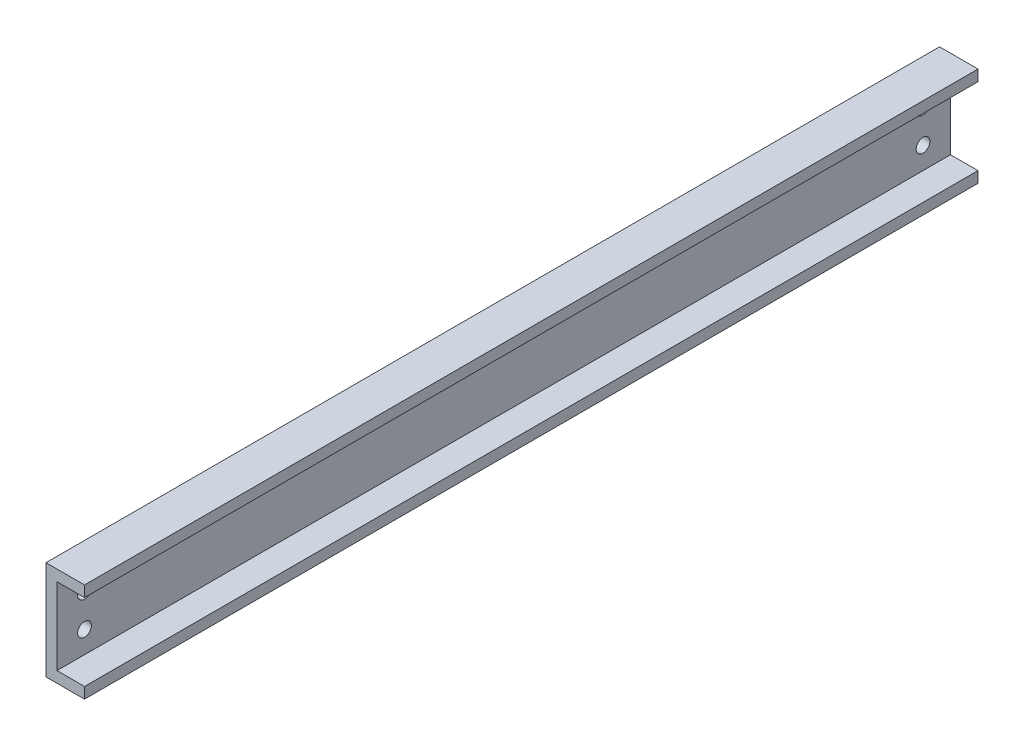
ISO-10303-21;
HEADER;
FILE_DESCRIPTION(('STEP AP214'),'2;1');
FILE_NAME('part.step','',(''),(''),'','','');
FILE_SCHEMA(('AUTOMOTIVE_DESIGN { 1 0 10303 214 1 1 1 1 }'));
ENDSEC;
DATA;
#1=APPLICATION_CONTEXT('core data for automotive mechanical design processes');
#2=APPLICATION_PROTOCOL_DEFINITION('international standard','automotive_design',2000,#1);
#3=PRODUCT_CONTEXT('',#1,'mechanical');
#4=PRODUCT('Part','Part','',(#3));
#5=PRODUCT_RELATED_PRODUCT_CATEGORY('part','',(#4));
#6=PRODUCT_DEFINITION_FORMATION('','',#4);
#7=PRODUCT_DEFINITION_CONTEXT('part definition',#1,'design');
#8=PRODUCT_DEFINITION('design','',#6,#7);
#9=PRODUCT_DEFINITION_SHAPE('','',#8);
#10=(LENGTH_UNIT() NAMED_UNIT(*) SI_UNIT(.MILLI.,.METRE.));
#11=(NAMED_UNIT(*) PLANE_ANGLE_UNIT() SI_UNIT($,.RADIAN.));
#12=(NAMED_UNIT(*) SI_UNIT($,.STERADIAN.) SOLID_ANGLE_UNIT());
#13=UNCERTAINTY_MEASURE_WITH_UNIT(LENGTH_MEASURE(1.E-05),#10,'distance_accuracy_value','');
#14=(GEOMETRIC_REPRESENTATION_CONTEXT(3) GLOBAL_UNCERTAINTY_ASSIGNED_CONTEXT((#13)) GLOBAL_UNIT_ASSIGNED_CONTEXT((#10,
#11,#12)) REPRESENTATION_CONTEXT('',''));
#15=CARTESIAN_POINT('',(0.,0.,0.));
#16=DIRECTION('',(0.,0.,1.));
#17=DIRECTION('',(1.,0.,0.));
#18=AXIS2_PLACEMENT_3D('',#15,#16,#17);
#19=CARTESIAN_POINT('',(0.,9.,-162.5));
#20=DIRECTION('',(0.,1.,0.));
#21=DIRECTION('',(0.,0.,1.));
#22=AXIS2_PLACEMENT_3D('',#19,#20,#21);
#23=PLANE('',#22);
#24=DIRECTION('',(-1.,0.,0.));
#25=VECTOR('',#24,1.);
#26=CARTESIAN_POINT('',(0.,9.,0.));
#27=LINE('',#26,#25);
#28=CARTESIAN_POINT('',(7.,9.,0.));
#29=VERTEX_POINT('',#28);
#30=CARTESIAN_POINT('',(0.,9.,0.));
#31=VERTEX_POINT('',#30);
#32=EDGE_CURVE('E134',#29,#31,#27,.T.);
#33=ORIENTED_EDGE('',*,*,#32,.F.);
#34=DIRECTION('',(0.,0.,1.));
#35=VECTOR('',#34,1.);
#36=CARTESIAN_POINT('',(7.,9.,-162.5));
#37=LINE('',#36,#35);
#38=CARTESIAN_POINT('',(7.,9.,-162.5));
#39=VERTEX_POINT('',#38);
#40=EDGE_CURVE('E11',#39,#29,#37,.T.);
#41=ORIENTED_EDGE('',*,*,#40,.F.);
#42=DIRECTION('',(-1.,0.,0.));
#43=VECTOR('',#42,1.);
#44=CARTESIAN_POINT('',(0.,9.,-162.5));
#45=LINE('',#44,#43);
#46=CARTESIAN_POINT('',(0.,9.,-162.5));
#47=VERTEX_POINT('',#46);
#48=EDGE_CURVE('E155',#39,#47,#45,.T.);
#49=ORIENTED_EDGE('',*,*,#48,.T.);
#50=DIRECTION('',(0.,0.,1.));
#51=VECTOR('',#50,1.);
#52=CARTESIAN_POINT('',(0.,9.,-162.5));
#53=LINE('',#52,#51);
#54=EDGE_CURVE('E40',#47,#31,#53,.T.);
#55=ORIENTED_EDGE('',*,*,#54,.T.);
#56=EDGE_LOOP('',(#33,#41,#49,#55));
#57=FACE_BOUND('',#56,.T.);
#58=ADVANCED_FACE('F37',(#57),#23,.T.);
#59=CARTESIAN_POINT('',(7.,9.,-162.5));
#60=DIRECTION('',(1.,0.,0.));
#61=DIRECTION('',(0.,0.,-1.));
#62=AXIS2_PLACEMENT_3D('',#59,#60,#61);
#63=PLANE('',#62);
#64=DIRECTION('',(0.,1.,0.));
#65=VECTOR('',#64,1.);
#66=CARTESIAN_POINT('',(7.,9.,0.));
#67=LINE('',#66,#65);
#68=CARTESIAN_POINT('',(7.,7.,0.));
#69=VERTEX_POINT('',#68);
#70=EDGE_CURVE('E153',#69,#29,#67,.T.);
#71=ORIENTED_EDGE('',*,*,#70,.F.);
#72=DIRECTION('',(0.,0.,1.));
#73=VECTOR('',#72,1.);
#74=CARTESIAN_POINT('',(7.,7.,-162.5));
#75=LINE('',#74,#73);
#76=CARTESIAN_POINT('',(7.,7.,-162.5));
#77=VERTEX_POINT('',#76);
#78=EDGE_CURVE('E46',#77,#69,#75,.T.);
#79=ORIENTED_EDGE('',*,*,#78,.F.);
#80=DIRECTION('',(0.,1.,0.));
#81=VECTOR('',#80,1.);
#82=CARTESIAN_POINT('',(7.,9.,-162.5));
#83=LINE('',#82,#81);
#84=EDGE_CURVE('E124',#77,#39,#83,.T.);
#85=ORIENTED_EDGE('',*,*,#84,.T.);
#86=ORIENTED_EDGE('',*,*,#40,.T.);
#87=EDGE_LOOP('',(#71,#79,#85,#86));
#88=FACE_BOUND('',#87,.T.);
#89=ADVANCED_FACE('F167',(#88),#63,.T.);
#90=CARTESIAN_POINT('',(2.,7.,-162.5));
#91=DIRECTION('',(0.,-1.,0.));
#92=DIRECTION('',(0.,0.,-1.));
#93=AXIS2_PLACEMENT_3D('',#90,#91,#92);
#94=PLANE('',#93);
#95=DIRECTION('',(1.,0.,0.));
#96=VECTOR('',#95,1.);
#97=CARTESIAN_POINT('',(2.,7.,0.));
#98=LINE('',#97,#96);
#99=CARTESIAN_POINT('',(2.,7.,0.));
#100=VERTEX_POINT('',#99);
#101=EDGE_CURVE('E111',#100,#69,#98,.T.);
#102=ORIENTED_EDGE('',*,*,#101,.F.);
#103=DIRECTION('',(0.,0.,1.));
#104=VECTOR('',#103,1.);
#105=CARTESIAN_POINT('',(2.,7.,-162.5));
#106=LINE('',#105,#104);
#107=CARTESIAN_POINT('',(2.,7.,-162.5));
#108=VERTEX_POINT('',#107);
#109=EDGE_CURVE('E106',#108,#100,#106,.T.);
#110=ORIENTED_EDGE('',*,*,#109,.F.);
#111=DIRECTION('',(1.,0.,0.));
#112=VECTOR('',#111,1.);
#113=CARTESIAN_POINT('',(2.,7.,-162.5));
#114=LINE('',#113,#112);
#115=EDGE_CURVE('E109',#108,#77,#114,.T.);
#116=ORIENTED_EDGE('',*,*,#115,.T.);
#117=ORIENTED_EDGE('',*,*,#78,.T.);
#118=EDGE_LOOP('',(#102,#110,#116,#117));
#119=FACE_BOUND('',#118,.T.);
#120=ADVANCED_FACE('F108',(#119),#94,.T.);
#121=CARTESIAN_POINT('',(2.,7.,-162.5));
#122=DIRECTION('',(1.,0.,0.));
#123=DIRECTION('',(0.,0.,-1.));
#124=AXIS2_PLACEMENT_3D('',#121,#122,#123);
#125=PLANE('',#124);
#126=CARTESIAN_POINT('',(2.,2.99999999999998,-157.5));
#127=DIRECTION('',(1.,0.,0.));
#128=DIRECTION('',(0.,0.,-1.));
#129=AXIS2_PLACEMENT_3D('',#126,#127,#128);
#130=CIRCLE('',#129,1.25000000000001);
#131=CARTESIAN_POINT('',(2.,2.99999999999998,-158.75));
#132=VERTEX_POINT('',#131);
#133=EDGE_CURVE('E138',#132,#132,#130,.T.);
#134=ORIENTED_EDGE('',*,*,#133,.F.);
#135=EDGE_LOOP('',(#134));
#136=FACE_BOUND('',#135,.T.);
#137=CARTESIAN_POINT('',(2.,-3.00000000000002,-157.5));
#138=DIRECTION('',(1.,0.,0.));
#139=DIRECTION('',(0.,0.,-1.));
#140=AXIS2_PLACEMENT_3D('',#137,#138,#139);
#141=CIRCLE('',#140,1.25000000000001);
#142=CARTESIAN_POINT('',(2.,-3.00000000000002,-158.75));
#143=VERTEX_POINT('',#142);
#144=EDGE_CURVE('E225',#143,#143,#141,.T.);
#145=ORIENTED_EDGE('',*,*,#144,.F.);
#146=EDGE_LOOP('',(#145));
#147=FACE_BOUND('',#146,.T.);
#148=CARTESIAN_POINT('',(2.,-3.,-5.));
#149=DIRECTION('',(1.,0.,0.));
#150=DIRECTION('',(0.,0.,-1.));
#151=AXIS2_PLACEMENT_3D('',#148,#149,#150);
#152=CIRCLE('',#151,1.25);
#153=CARTESIAN_POINT('',(2.,-3.,-6.25));
#154=VERTEX_POINT('',#153);
#155=EDGE_CURVE('E217',#154,#154,#152,.T.);
#156=ORIENTED_EDGE('',*,*,#155,.F.);
#157=EDGE_LOOP('',(#156));
#158=FACE_BOUND('',#157,.T.);
#159=CARTESIAN_POINT('',(2.,3.,-5.));
#160=DIRECTION('',(1.,0.,0.));
#161=DIRECTION('',(0.,0.,-1.));
#162=AXIS2_PLACEMENT_3D('',#159,#160,#161);
#163=CIRCLE('',#162,1.25);
#164=CARTESIAN_POINT('',(2.,3.,-6.25));
#165=VERTEX_POINT('',#164);
#166=EDGE_CURVE('E214',#165,#165,#163,.T.);
#167=ORIENTED_EDGE('',*,*,#166,.F.);
#168=EDGE_LOOP('',(#167));
#169=FACE_BOUND('',#168,.T.);
#170=DIRECTION('',(0.,1.,0.));
#171=VECTOR('',#170,1.);
#172=CARTESIAN_POINT('',(2.,7.,0.));
#173=LINE('',#172,#171);
#174=CARTESIAN_POINT('',(2.,-7.,0.));
#175=VERTEX_POINT('',#174);
#176=EDGE_CURVE('E150',#175,#100,#173,.T.);
#177=ORIENTED_EDGE('',*,*,#176,.F.);
#178=DIRECTION('',(0.,0.,1.));
#179=VECTOR('',#178,1.);
#180=CARTESIAN_POINT('',(2.,-7.,-162.5));
#181=LINE('',#180,#179);
#182=CARTESIAN_POINT('',(2.,-7.,-162.5));
#183=VERTEX_POINT('',#182);
#184=EDGE_CURVE('E116',#183,#175,#181,.T.);
#185=ORIENTED_EDGE('',*,*,#184,.F.);
#186=DIRECTION('',(0.,1.,0.));
#187=VECTOR('',#186,1.);
#188=CARTESIAN_POINT('',(2.,7.,-162.5));
#189=LINE('',#188,#187);
#190=EDGE_CURVE('E122',#183,#108,#189,.T.);
#191=ORIENTED_EDGE('',*,*,#190,.T.);
#192=ORIENTED_EDGE('',*,*,#109,.T.);
#193=EDGE_LOOP('',(#177,#185,#191,#192));
#194=FACE_BOUND('',#193,.T.);
#195=ADVANCED_FACE('F126',(#136,#147,#158,#169,#194),#125,.T.);
#196=CARTESIAN_POINT('',(2.,-7.,-162.5));
#197=DIRECTION('',(0.,1.,0.));
#198=DIRECTION('',(-1.,0.,0.));
#199=AXIS2_PLACEMENT_3D('',#196,#197,#198);
#200=PLANE('',#199);
#201=DIRECTION('',(-1.,0.,0.));
#202=VECTOR('',#201,1.);
#203=CARTESIAN_POINT('',(2.,-7.,0.));
#204=LINE('',#203,#202);
#205=CARTESIAN_POINT('',(7.,-7.,0.));
#206=VERTEX_POINT('',#205);
#207=EDGE_CURVE('E147',#206,#175,#204,.T.);
#208=ORIENTED_EDGE('',*,*,#207,.F.);
#209=DIRECTION('',(0.,0.,1.));
#210=VECTOR('',#209,1.);
#211=CARTESIAN_POINT('',(7.,-7.,-162.5));
#212=LINE('',#211,#210);
#213=CARTESIAN_POINT('',(7.,-7.,-162.5));
#214=VERTEX_POINT('',#213);
#215=EDGE_CURVE('E159',#214,#206,#212,.T.);
#216=ORIENTED_EDGE('',*,*,#215,.F.);
#217=DIRECTION('',(-1.,0.,0.));
#218=VECTOR('',#217,1.);
#219=CARTESIAN_POINT('',(2.,-7.,-162.5));
#220=LINE('',#219,#218);
#221=EDGE_CURVE('E127',#214,#183,#220,.T.);
#222=ORIENTED_EDGE('',*,*,#221,.T.);
#223=ORIENTED_EDGE('',*,*,#184,.T.);
#224=EDGE_LOOP('',(#208,#216,#222,#223));
#225=FACE_BOUND('',#224,.T.);
#226=ADVANCED_FACE('F180',(#225),#200,.T.);
#227=CARTESIAN_POINT('',(7.,-9.,-162.5));
#228=DIRECTION('',(1.,0.,0.));
#229=DIRECTION('',(0.,0.,-1.));
#230=AXIS2_PLACEMENT_3D('',#227,#228,#229);
#231=PLANE('',#230);
#232=DIRECTION('',(0.,1.,0.));
#233=VECTOR('',#232,1.);
#234=CARTESIAN_POINT('',(7.,-9.,0.));
#235=LINE('',#234,#233);
#236=CARTESIAN_POINT('',(7.,-9.,0.));
#237=VERTEX_POINT('',#236);
#238=EDGE_CURVE('E144',#237,#206,#235,.T.);
#239=ORIENTED_EDGE('',*,*,#238,.F.);
#240=DIRECTION('',(0.,0.,1.));
#241=VECTOR('',#240,1.);
#242=CARTESIAN_POINT('',(7.,-9.,-162.5));
#243=LINE('',#242,#241);
#244=CARTESIAN_POINT('',(7.,-9.,-162.5));
#245=VERTEX_POINT('',#244);
#246=EDGE_CURVE('E161',#245,#237,#243,.T.);
#247=ORIENTED_EDGE('',*,*,#246,.F.);
#248=DIRECTION('',(0.,1.,0.));
#249=VECTOR('',#248,1.);
#250=CARTESIAN_POINT('',(7.,-9.,-162.5));
#251=LINE('',#250,#249);
#252=EDGE_CURVE('E129',#245,#214,#251,.T.);
#253=ORIENTED_EDGE('',*,*,#252,.T.);
#254=ORIENTED_EDGE('',*,*,#215,.T.);
#255=EDGE_LOOP('',(#239,#247,#253,#254));
#256=FACE_BOUND('',#255,.T.);
#257=ADVANCED_FACE('F184',(#256),#231,.T.);
#258=CARTESIAN_POINT('',(0.,-9.,-162.5));
#259=DIRECTION('',(0.,-1.,0.));
#260=DIRECTION('',(0.,0.,-1.));
#261=AXIS2_PLACEMENT_3D('',#258,#259,#260);
#262=PLANE('',#261);
#263=DIRECTION('',(1.,0.,0.));
#264=VECTOR('',#263,1.);
#265=CARTESIAN_POINT('',(0.,-9.,0.));
#266=LINE('',#265,#264);
#267=CARTESIAN_POINT('',(0.,-9.,0.));
#268=VERTEX_POINT('',#267);
#269=EDGE_CURVE('E141',#268,#237,#266,.T.);
#270=ORIENTED_EDGE('',*,*,#269,.F.);
#271=DIRECTION('',(0.,0.,1.));
#272=VECTOR('',#271,1.);
#273=CARTESIAN_POINT('',(0.,-9.,-162.5));
#274=LINE('',#273,#272);
#275=CARTESIAN_POINT('',(0.,-9.,-162.5));
#276=VERTEX_POINT('',#275);
#277=EDGE_CURVE('E162',#276,#268,#274,.T.);
#278=ORIENTED_EDGE('',*,*,#277,.F.);
#279=DIRECTION('',(1.,0.,0.));
#280=VECTOR('',#279,1.);
#281=CARTESIAN_POINT('',(0.,-9.,-162.5));
#282=LINE('',#281,#280);
#283=EDGE_CURVE('E233',#276,#245,#282,.T.);
#284=ORIENTED_EDGE('',*,*,#283,.T.);
#285=ORIENTED_EDGE('',*,*,#246,.T.);
#286=EDGE_LOOP('',(#270,#278,#284,#285));
#287=FACE_BOUND('',#286,.T.);
#288=ADVANCED_FACE('F188',(#287),#262,.T.);
#289=CARTESIAN_POINT('',(0.,9.,-162.5));
#290=DIRECTION('',(-1.,0.,0.));
#291=DIRECTION('',(0.,-1.,0.));
#292=AXIS2_PLACEMENT_3D('',#289,#290,#291);
#293=PLANE('',#292);
#294=CARTESIAN_POINT('',(0.,2.99999999999998,-157.5));
#295=DIRECTION('',(-1.,0.,0.));
#296=DIRECTION('',(0.,1.,0.));
#297=AXIS2_PLACEMENT_3D('',#294,#295,#296);
#298=CIRCLE('',#297,1.25000000000001);
#299=CARTESIAN_POINT('',(0.,4.24999999999999,-157.5));
#300=VERTEX_POINT('',#299);
#301=EDGE_CURVE('E201',#300,#300,#298,.T.);
#302=ORIENTED_EDGE('',*,*,#301,.F.);
#303=EDGE_LOOP('',(#302));
#304=FACE_BOUND('',#303,.T.);
#305=CARTESIAN_POINT('',(0.,-3.00000000000002,-157.5));
#306=DIRECTION('',(-1.,0.,0.));
#307=DIRECTION('',(0.,-1.,0.));
#308=AXIS2_PLACEMENT_3D('',#305,#306,#307);
#309=CIRCLE('',#308,1.25000000000001);
#310=CARTESIAN_POINT('',(0.,-4.25000000000003,-157.5));
#311=VERTEX_POINT('',#310);
#312=EDGE_CURVE('E205',#311,#311,#309,.T.);
#313=ORIENTED_EDGE('',*,*,#312,.F.);
#314=EDGE_LOOP('',(#313));
#315=FACE_BOUND('',#314,.T.);
#316=CARTESIAN_POINT('',(0.,-3.,-5.));
#317=DIRECTION('',(-1.,0.,0.));
#318=DIRECTION('',(0.,1.,0.));
#319=AXIS2_PLACEMENT_3D('',#316,#317,#318);
#320=CIRCLE('',#319,1.25);
#321=CARTESIAN_POINT('',(0.,-1.75,-5.));
#322=VERTEX_POINT('',#321);
#323=EDGE_CURVE('E209',#322,#322,#320,.T.);
#324=ORIENTED_EDGE('',*,*,#323,.F.);
#325=EDGE_LOOP('',(#324));
#326=FACE_BOUND('',#325,.T.);
#327=CARTESIAN_POINT('',(0.,3.,-5.));
#328=DIRECTION('',(-1.,0.,0.));
#329=DIRECTION('',(0.,-1.,0.));
#330=AXIS2_PLACEMENT_3D('',#327,#328,#329);
#331=CIRCLE('',#330,1.25);
#332=CARTESIAN_POINT('',(0.,1.75,-5.));
#333=VERTEX_POINT('',#332);
#334=EDGE_CURVE('E212',#333,#333,#331,.T.);
#335=ORIENTED_EDGE('',*,*,#334,.F.);
#336=EDGE_LOOP('',(#335));
#337=FACE_BOUND('',#336,.T.);
#338=DIRECTION('',(0.,-1.,0.));
#339=VECTOR('',#338,1.);
#340=CARTESIAN_POINT('',(0.,9.,0.));
#341=LINE('',#340,#339);
#342=EDGE_CURVE('E137',#31,#268,#341,.T.);
#343=ORIENTED_EDGE('',*,*,#342,.F.);
#344=ORIENTED_EDGE('',*,*,#54,.F.);
#345=DIRECTION('',(0.,-1.,0.));
#346=VECTOR('',#345,1.);
#347=CARTESIAN_POINT('',(0.,9.,-162.5));
#348=LINE('',#347,#346);
#349=EDGE_CURVE('E231',#47,#276,#348,.T.);
#350=ORIENTED_EDGE('',*,*,#349,.T.);
#351=ORIENTED_EDGE('',*,*,#277,.T.);
#352=EDGE_LOOP('',(#343,#344,#350,#351));
#353=FACE_BOUND('',#352,.T.);
#354=ADVANCED_FACE('F164',(#304,#315,#326,#337,#353),#293,.T.);
#355=CARTESIAN_POINT('',(0.,0.,-162.5));
#356=DIRECTION('',(0.,0.,-1.));
#357=DIRECTION('',(-1.,0.,0.));
#358=AXIS2_PLACEMENT_3D('',#355,#356,#357);
#359=PLANE('',#358);
#360=ORIENTED_EDGE('',*,*,#48,.F.);
#361=ORIENTED_EDGE('',*,*,#84,.F.);
#362=ORIENTED_EDGE('',*,*,#115,.F.);
#363=ORIENTED_EDGE('',*,*,#190,.F.);
#364=ORIENTED_EDGE('',*,*,#221,.F.);
#365=ORIENTED_EDGE('',*,*,#252,.F.);
#366=ORIENTED_EDGE('',*,*,#283,.F.);
#367=ORIENTED_EDGE('',*,*,#349,.F.);
#368=EDGE_LOOP('',(#360,#361,#362,#363,#364,#365,#366,#367));
#369=FACE_BOUND('',#368,.T.);
#370=ADVANCED_FACE('F120',(#369),#359,.T.);
#371=CARTESIAN_POINT('',(0.,0.,0.));
#372=DIRECTION('',(0.,0.,-1.));
#373=DIRECTION('',(-1.,0.,0.));
#374=AXIS2_PLACEMENT_3D('',#371,#372,#373);
#375=PLANE('',#374);
#376=ORIENTED_EDGE('',*,*,#32,.T.);
#377=ORIENTED_EDGE('',*,*,#342,.T.);
#378=ORIENTED_EDGE('',*,*,#269,.T.);
#379=ORIENTED_EDGE('',*,*,#238,.T.);
#380=ORIENTED_EDGE('',*,*,#207,.T.);
#381=ORIENTED_EDGE('',*,*,#176,.T.);
#382=ORIENTED_EDGE('',*,*,#101,.T.);
#383=ORIENTED_EDGE('',*,*,#70,.T.);
#384=EDGE_LOOP('',(#376,#377,#378,#379,#380,#381,#382,#383));
#385=FACE_BOUND('',#384,.T.);
#386=ADVANCED_FACE('F166',(#385),#375,.F.);
#387=CARTESIAN_POINT('',(7.,3.,-5.));
#388=DIRECTION('',(-1.,0.,0.));
#389=DIRECTION('',(0.,-1.,0.));
#390=AXIS2_PLACEMENT_3D('',#387,#388,#389);
#391=CYLINDRICAL_SURFACE('',#390,1.25);
#392=ORIENTED_EDGE('',*,*,#166,.T.);
#393=EDGE_LOOP('',(#392));
#394=FACE_BOUND('',#393,.T.);
#395=ORIENTED_EDGE('',*,*,#334,.T.);
#396=EDGE_LOOP('',(#395));
#397=FACE_BOUND('',#396,.T.);
#398=ADVANCED_FACE('F251',(#394,#397),#391,.F.);
#399=CARTESIAN_POINT('',(7.,-3.,-5.));
#400=DIRECTION('',(-1.,0.,0.));
#401=DIRECTION('',(0.,-1.,0.));
#402=AXIS2_PLACEMENT_3D('',#399,#400,#401);
#403=CYLINDRICAL_SURFACE('',#402,1.25);
#404=ORIENTED_EDGE('',*,*,#155,.T.);
#405=EDGE_LOOP('',(#404));
#406=FACE_BOUND('',#405,.T.);
#407=ORIENTED_EDGE('',*,*,#323,.T.);
#408=EDGE_LOOP('',(#407));
#409=FACE_BOUND('',#408,.T.);
#410=ADVANCED_FACE('F253',(#406,#409),#403,.F.);
#411=CARTESIAN_POINT('',(7.,-3.00000000000002,-157.5));
#412=DIRECTION('',(-1.,0.,0.));
#413=DIRECTION('',(0.,-1.,0.));
#414=AXIS2_PLACEMENT_3D('',#411,#412,#413);
#415=CYLINDRICAL_SURFACE('',#414,1.25000000000001);
#416=ORIENTED_EDGE('',*,*,#144,.T.);
#417=EDGE_LOOP('',(#416));
#418=FACE_BOUND('',#417,.T.);
#419=ORIENTED_EDGE('',*,*,#312,.T.);
#420=EDGE_LOOP('',(#419));
#421=FACE_BOUND('',#420,.T.);
#422=ADVANCED_FACE('F258',(#418,#421),#415,.F.);
#423=CARTESIAN_POINT('',(7.,2.99999999999998,-157.5));
#424=DIRECTION('',(-1.,0.,0.));
#425=DIRECTION('',(0.,-1.,0.));
#426=AXIS2_PLACEMENT_3D('',#423,#424,#425);
#427=CYLINDRICAL_SURFACE('',#426,1.25000000000001);
#428=ORIENTED_EDGE('',*,*,#133,.T.);
#429=EDGE_LOOP('',(#428));
#430=FACE_BOUND('',#429,.T.);
#431=ORIENTED_EDGE('',*,*,#301,.T.);
#432=EDGE_LOOP('',(#431));
#433=FACE_BOUND('',#432,.T.);
#434=ADVANCED_FACE('F242',(#430,#433),#427,.F.);
#435=CLOSED_SHELL('',(#58,#89,#120,#195,#226,#257,#288,#354,#370,#386,#398,#410,#422,#434));
#436=MANIFOLD_SOLID_BREP('B2',#435);
#437=ADVANCED_BREP_SHAPE_REPRESENTATION('',(#18,#436),#14);
#438=SHAPE_DEFINITION_REPRESENTATION(#9,#437);
ENDSEC;
END-ISO-10303-21;
